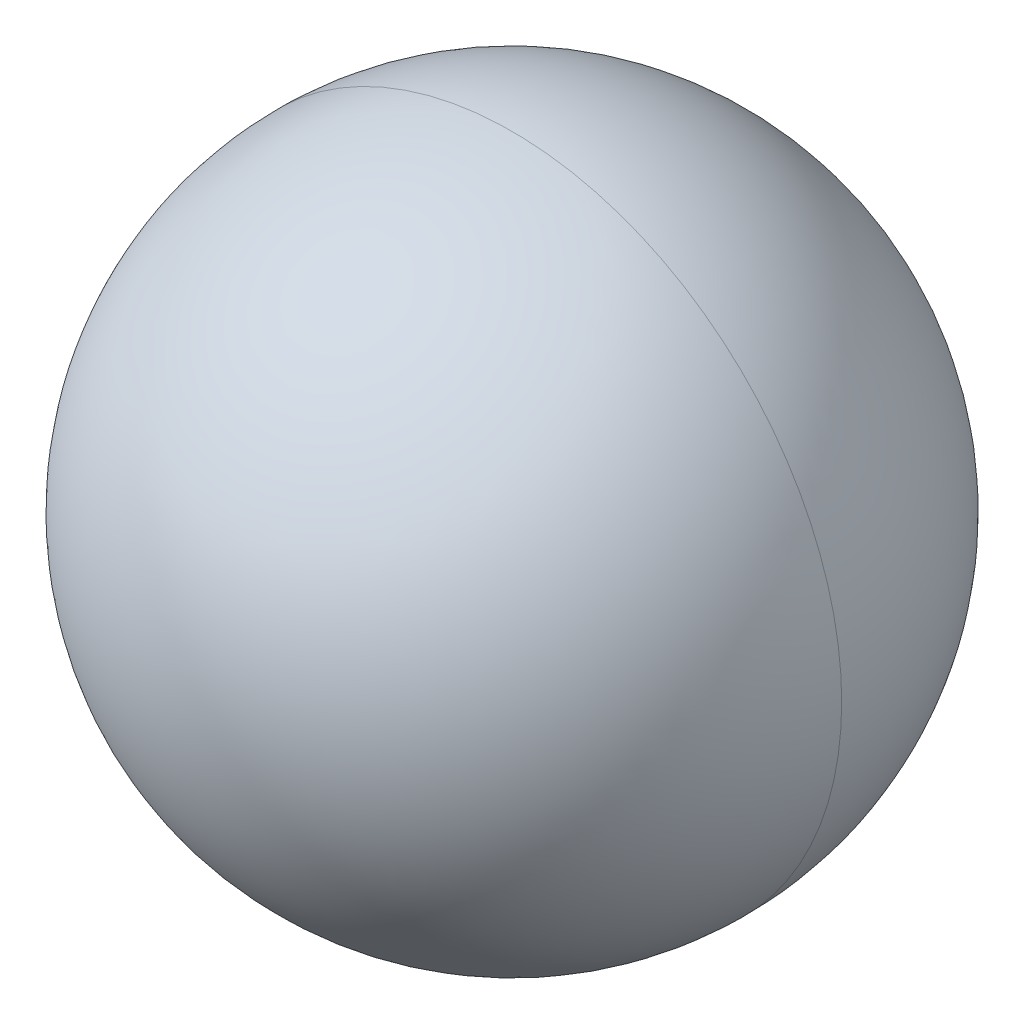
ISO-10303-21;
HEADER;
FILE_DESCRIPTION(('STEP AP214'),'2;1');
FILE_NAME('part.step','',(''),(''),'','','');
FILE_SCHEMA(('AUTOMOTIVE_DESIGN { 1 0 10303 214 1 1 1 1 }'));
ENDSEC;
DATA;
#1=APPLICATION_CONTEXT('core data for automotive mechanical design processes');
#2=APPLICATION_PROTOCOL_DEFINITION('international standard','automotive_design',2000,#1);
#3=PRODUCT_CONTEXT('',#1,'mechanical');
#4=PRODUCT('Part','Part','',(#3));
#5=PRODUCT_RELATED_PRODUCT_CATEGORY('part','',(#4));
#6=PRODUCT_DEFINITION_FORMATION('','',#4);
#7=PRODUCT_DEFINITION_CONTEXT('part definition',#1,'design');
#8=PRODUCT_DEFINITION('design','',#6,#7);
#9=PRODUCT_DEFINITION_SHAPE('','',#8);
#10=(LENGTH_UNIT() NAMED_UNIT(*) SI_UNIT(.MILLI.,.METRE.));
#11=(NAMED_UNIT(*) PLANE_ANGLE_UNIT() SI_UNIT($,.RADIAN.));
#12=(NAMED_UNIT(*) SI_UNIT($,.STERADIAN.) SOLID_ANGLE_UNIT());
#13=UNCERTAINTY_MEASURE_WITH_UNIT(LENGTH_MEASURE(1.E-05),#10,'distance_accuracy_value','');
#14=(GEOMETRIC_REPRESENTATION_CONTEXT(3) GLOBAL_UNCERTAINTY_ASSIGNED_CONTEXT((#13)) GLOBAL_UNIT_ASSIGNED_CONTEXT((#10,
#11,#12)) REPRESENTATION_CONTEXT('',''));
#15=CARTESIAN_POINT('',(0.,0.,0.));
#16=DIRECTION('',(0.,0.,1.));
#17=DIRECTION('',(1.,0.,0.));
#18=AXIS2_PLACEMENT_3D('',#15,#16,#17);
#19=CARTESIAN_POINT('',(3.5,18.,0.));
#20=DIRECTION('',(1.,0.,0.));
#21=DIRECTION('',(0.,0.,-1.));
#22=AXIS2_PLACEMENT_3D('',#19,#20,#21);
#23=SPHERICAL_SURFACE('',#22,1.75);
#24=CARTESIAN_POINT('',(3.5,18.,0.));
#25=DIRECTION('',(0.,0.,1.));
#26=DIRECTION('',(1.,0.,0.));
#27=AXIS2_PLACEMENT_3D('',#24,#25,#26);
#28=CIRCLE('',#27,1.75);
#29=CARTESIAN_POINT('',(5.25,18.,0.));
#30=VERTEX_POINT('',#29);
#31=CARTESIAN_POINT('',(1.75,18.,0.));
#32=VERTEX_POINT('',#31);
#33=EDGE_CURVE('E11',#30,#32,#28,.T.);
#34=ORIENTED_EDGE('',*,*,#33,.T.);
#35=CARTESIAN_POINT('',(3.5,18.,0.));
#36=DIRECTION('',(0.,0.,-1.));
#37=DIRECTION('',(1.,0.,0.));
#38=AXIS2_PLACEMENT_3D('',#35,#36,#37);
#39=CIRCLE('',#38,1.75);
#40=EDGE_CURVE('E25',#30,#32,#39,.T.);
#41=ORIENTED_EDGE('',*,*,#40,.F.);
#42=EDGE_LOOP('',(#34,#41));
#43=FACE_BOUND('',#42,.T.);
#44=ADVANCED_FACE('F17',(#43),#23,.T.);
#45=CARTESIAN_POINT('',(3.5,18.,0.));
#46=DIRECTION('',(1.,0.,0.));
#47=DIRECTION('',(0.,0.,1.));
#48=AXIS2_PLACEMENT_3D('',#45,#46,#47);
#49=SPHERICAL_SURFACE('',#48,1.75);
#50=ORIENTED_EDGE('',*,*,#33,.F.);
#51=ORIENTED_EDGE('',*,*,#40,.T.);
#52=EDGE_LOOP('',(#50,#51));
#53=FACE_BOUND('',#52,.T.);
#54=ADVANCED_FACE('F33',(#53),#49,.T.);
#55=CLOSED_SHELL('',(#44,#54));
#56=MANIFOLD_SOLID_BREP('B1',#55);
#57=ADVANCED_BREP_SHAPE_REPRESENTATION('',(#18,#56),#14);
#58=SHAPE_DEFINITION_REPRESENTATION(#9,#57);
ENDSEC;
END-ISO-10303-21;
